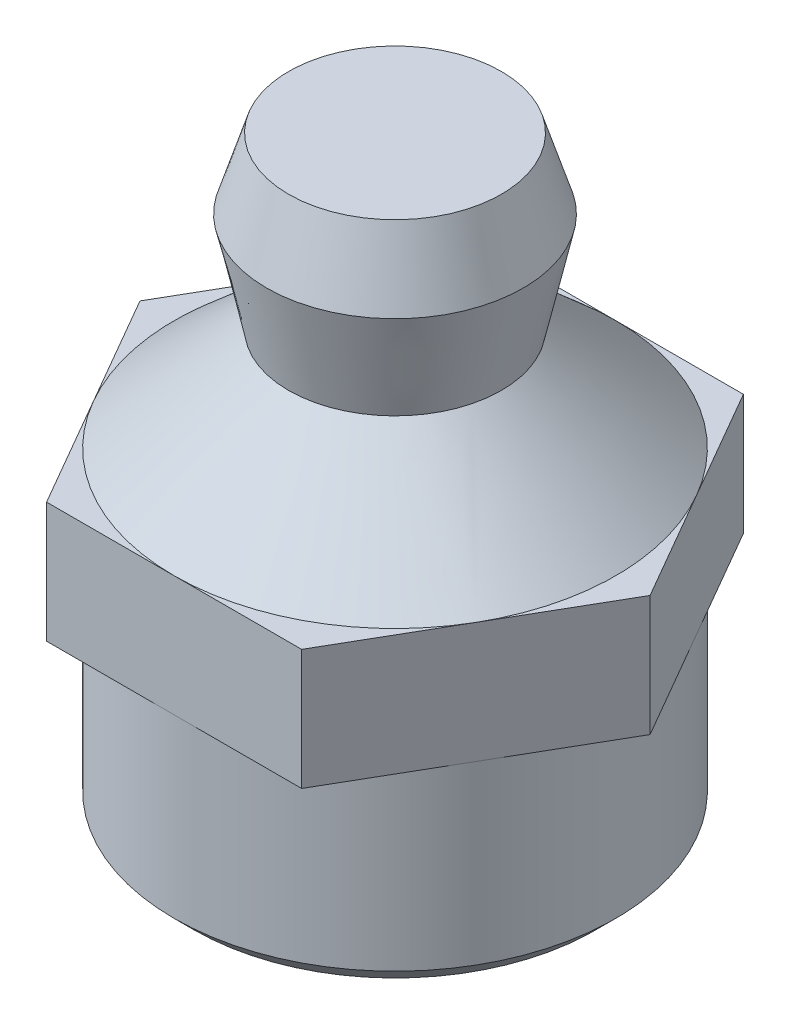
ISO-10303-21;
HEADER;
FILE_DESCRIPTION(('STEP AP214'),'2;1');
FILE_NAME('part.step','',(''),(''),'','','');
FILE_SCHEMA(('AUTOMOTIVE_DESIGN { 1 0 10303 214 1 1 1 1 }'));
ENDSEC;
DATA;
#1=APPLICATION_CONTEXT('core data for automotive mechanical design processes');
#2=APPLICATION_PROTOCOL_DEFINITION('international standard','automotive_design',2000,#1);
#3=PRODUCT_CONTEXT('',#1,'mechanical');
#4=PRODUCT('Part','Part','',(#3));
#5=PRODUCT_RELATED_PRODUCT_CATEGORY('part','',(#4));
#6=PRODUCT_DEFINITION_FORMATION('','',#4);
#7=PRODUCT_DEFINITION_CONTEXT('part definition',#1,'design');
#8=PRODUCT_DEFINITION('design','',#6,#7);
#9=PRODUCT_DEFINITION_SHAPE('','',#8);
#10=(LENGTH_UNIT() NAMED_UNIT(*) SI_UNIT(.MILLI.,.METRE.));
#11=(NAMED_UNIT(*) PLANE_ANGLE_UNIT() SI_UNIT($,.RADIAN.));
#12=(NAMED_UNIT(*) SI_UNIT($,.STERADIAN.) SOLID_ANGLE_UNIT());
#13=UNCERTAINTY_MEASURE_WITH_UNIT(LENGTH_MEASURE(1.E-05),#10,'distance_accuracy_value','');
#14=(GEOMETRIC_REPRESENTATION_CONTEXT(3) GLOBAL_UNCERTAINTY_ASSIGNED_CONTEXT((#13)) GLOBAL_UNIT_ASSIGNED_CONTEXT((#10,
#11,#12)) REPRESENTATION_CONTEXT('',''));
#15=CARTESIAN_POINT('',(0.,0.,0.));
#16=DIRECTION('',(0.,0.,1.));
#17=DIRECTION('',(1.,0.,0.));
#18=AXIS2_PLACEMENT_3D('',#15,#16,#17);
#19=CARTESIAN_POINT('',(0.,7.89,0.));
#20=DIRECTION('',(0.,1.,0.));
#21=DIRECTION('',(0.,0.,1.));
#22=AXIS2_PLACEMENT_3D('',#19,#20,#21);
#23=PLANE('',#22);
#24=CARTESIAN_POINT('',(0.,7.89,0.));
#25=DIRECTION('',(0.,1.,0.));
#26=DIRECTION('',(0.,0.,1.));
#27=AXIS2_PLACEMENT_3D('',#24,#25,#26);
#28=CIRCLE('',#27,5.5);
#29=CARTESIAN_POINT('',(4.76318355730142,7.89,2.74992407297728));
#30=VERTEX_POINT('',#29);
#31=CARTESIAN_POINT('',(4.76313972081441,7.89,-2.75));
#32=VERTEX_POINT('',#31);
#33=EDGE_CURVE('E183',#30,#32,#28,.T.);
#34=ORIENTED_EDGE('',*,*,#33,.F.);
#35=DIRECTION('',(0.5,0.,-0.866025403784439));
#36=VECTOR('',#35,1.);
#37=CARTESIAN_POINT('',(3.17542648054294,7.89,5.5));
#38=LINE('',#37,#36);
#39=CARTESIAN_POINT('',(6.35085296108589,7.89,0.));
#40=VERTEX_POINT('',#39);
#41=EDGE_CURVE('E171',#30,#40,#38,.T.);
#42=ORIENTED_EDGE('',*,*,#41,.T.);
#43=DIRECTION('',(-0.5,0.,-0.866025403784439));
#44=VECTOR('',#43,1.);
#45=CARTESIAN_POINT('',(6.35085296108589,7.89,0.));
#46=LINE('',#45,#44);
#47=EDGE_CURVE('E276',#40,#32,#46,.T.);
#48=ORIENTED_EDGE('',*,*,#47,.T.);
#49=EDGE_LOOP('',(#34,#42,#48));
#50=FACE_BOUND('',#49,.T.);
#51=ADVANCED_FACE('F48',(#50),#23,.T.);
#52=CARTESIAN_POINT('',(4.76299991361249,7.89,-2.750242153177));
#53=VERTEX_POINT('',#52);
#54=CARTESIAN_POINT('',(0.000547969122027901,7.89,-5.50000000000001));
#55=VERTEX_POINT('',#54);
#56=EDGE_CURVE('E264',#53,#55,#28,.T.);
#57=ORIENTED_EDGE('',*,*,#56,.F.);
#58=CARTESIAN_POINT('',(3.17542648054294,7.89,-5.50000000000001));
#59=VERTEX_POINT('',#58);
#60=EDGE_CURVE('E170',#53,#59,#46,.T.);
#61=ORIENTED_EDGE('',*,*,#60,.T.);
#62=DIRECTION('',(-1.,0.,0.));
#63=VECTOR('',#62,1.);
#64=CARTESIAN_POINT('',(3.17542648054294,7.89,-5.50000000000001));
#65=LINE('',#64,#63);
#66=EDGE_CURVE('E409',#59,#55,#65,.T.);
#67=ORIENTED_EDGE('',*,*,#66,.T.);
#68=EDGE_LOOP('',(#57,#61,#67));
#69=FACE_BOUND('',#68,.T.);
#70=ADVANCED_FACE('F509',(#69),#23,.T.);
#71=CARTESIAN_POINT('',(0.,7.89,-5.50000000000001));
#72=VERTEX_POINT('',#71);
#73=CARTESIAN_POINT('',(-4.76313972081442,7.89,-2.75));
#74=VERTEX_POINT('',#73);
#75=EDGE_CURVE('E67',#72,#74,#28,.T.);
#76=ORIENTED_EDGE('',*,*,#75,.F.);
#77=CARTESIAN_POINT('',(-3.17542648054294,7.89,-5.50000000000001));
#78=VERTEX_POINT('',#77);
#79=EDGE_CURVE('E398',#72,#78,#65,.T.);
#80=ORIENTED_EDGE('',*,*,#79,.T.);
#81=DIRECTION('',(-0.5,0.,0.866025403784439));
#82=VECTOR('',#81,1.);
#83=CARTESIAN_POINT('',(-3.17542648054294,7.89,-5.50000000000001));
#84=LINE('',#83,#82);
#85=EDGE_CURVE('E381',#78,#74,#84,.T.);
#86=ORIENTED_EDGE('',*,*,#85,.T.);
#87=EDGE_LOOP('',(#76,#80,#86));
#88=FACE_BOUND('',#87,.T.);
#89=ADVANCED_FACE('F415',(#88),#23,.T.);
#90=CARTESIAN_POINT('',(-4.76318355730102,7.89,-2.74992407297798));
#91=VERTEX_POINT('',#90);
#92=CARTESIAN_POINT('',(-4.76313972081442,7.89,2.75));
#93=VERTEX_POINT('',#92);
#94=EDGE_CURVE('E333',#91,#93,#28,.T.);
#95=ORIENTED_EDGE('',*,*,#94,.F.);
#96=CARTESIAN_POINT('',(-6.35085296108589,7.89,0.));
#97=VERTEX_POINT('',#96);
#98=EDGE_CURVE('E377',#91,#97,#84,.T.);
#99=ORIENTED_EDGE('',*,*,#98,.T.);
#100=DIRECTION('',(0.5,0.,0.866025403784439));
#101=VECTOR('',#100,1.);
#102=CARTESIAN_POINT('',(-6.35085296108589,7.89,0.));
#103=LINE('',#102,#101);
#104=EDGE_CURVE('E371',#97,#93,#103,.T.);
#105=ORIENTED_EDGE('',*,*,#104,.T.);
#106=EDGE_LOOP('',(#95,#99,#105));
#107=FACE_BOUND('',#106,.T.);
#108=ADVANCED_FACE('F376',(#107),#23,.T.);
#109=CARTESIAN_POINT('',(-4.76299991361188,7.89,2.75024215317805));
#110=VERTEX_POINT('',#109);
#111=CARTESIAN_POINT('',(0.,7.89,5.5));
#112=VERTEX_POINT('',#111);
#113=EDGE_CURVE('E190',#110,#112,#28,.T.);
#114=ORIENTED_EDGE('',*,*,#113,.F.);
#115=CARTESIAN_POINT('',(-3.17542648054294,7.89,5.5));
#116=VERTEX_POINT('',#115);
#117=EDGE_CURVE('E374',#110,#116,#103,.T.);
#118=ORIENTED_EDGE('',*,*,#117,.T.);
#119=DIRECTION('',(1.,0.,0.));
#120=VECTOR('',#119,1.);
#121=CARTESIAN_POINT('',(-3.17542648054294,7.89,5.5));
#122=LINE('',#121,#120);
#123=EDGE_CURVE('E379',#116,#112,#122,.T.);
#124=ORIENTED_EDGE('',*,*,#123,.T.);
#125=EDGE_LOOP('',(#114,#118,#124));
#126=FACE_BOUND('',#125,.T.);
#127=ADVANCED_FACE('F229',(#126),#23,.T.);
#128=CARTESIAN_POINT('',(0.,4.89,0.));
#129=DIRECTION('',(0.,-1.,0.));
#130=DIRECTION('',(0.,0.,-1.));
#131=AXIS2_PLACEMENT_3D('',#128,#129,#130);
#132=CYLINDRICAL_SURFACE('',#131,5.5);
#133=CARTESIAN_POINT('',(0.,0.499999999999999,0.));
#134=DIRECTION('',(0.,1.,0.));
#135=DIRECTION('',(0.,0.,1.));
#136=AXIS2_PLACEMENT_3D('',#133,#134,#135);
#137=CIRCLE('',#136,5.5);
#138=CARTESIAN_POINT('',(0.,0.499999999999999,5.5));
#139=VERTEX_POINT('',#138);
#140=EDGE_CURVE('E425',#139,#139,#137,.T.);
#141=ORIENTED_EDGE('',*,*,#140,.T.);
#142=EDGE_LOOP('',(#141));
#143=FACE_BOUND('',#142,.T.);
#144=CARTESIAN_POINT('',(0.,4.89,0.));
#145=DIRECTION('',(0.,1.,0.));
#146=DIRECTION('',(0.,0.,1.));
#147=AXIS2_PLACEMENT_3D('',#144,#145,#146);
#148=CIRCLE('',#147,5.5);
#149=CARTESIAN_POINT('',(0.,4.89,5.5));
#150=VERTEX_POINT('',#149);
#151=CARTESIAN_POINT('',(4.76313972081442,4.89,2.75));
#152=VERTEX_POINT('',#151);
#153=EDGE_CURVE('E428',#150,#152,#148,.T.);
#154=ORIENTED_EDGE('',*,*,#153,.F.);
#155=CARTESIAN_POINT('',(-4.76313972081442,4.89,2.75));
#156=VERTEX_POINT('',#155);
#157=EDGE_CURVE('E431',#156,#150,#148,.T.);
#158=ORIENTED_EDGE('',*,*,#157,.F.);
#159=CARTESIAN_POINT('',(-4.76313972081442,4.89,-2.75));
#160=VERTEX_POINT('',#159);
#161=EDGE_CURVE('E552',#160,#156,#148,.T.);
#162=ORIENTED_EDGE('',*,*,#161,.F.);
#163=CARTESIAN_POINT('',(0.,4.89,-5.5));
#164=VERTEX_POINT('',#163);
#165=EDGE_CURVE('E548',#164,#160,#148,.T.);
#166=ORIENTED_EDGE('',*,*,#165,.F.);
#167=CARTESIAN_POINT('',(4.76313972081442,4.89,-2.75));
#168=VERTEX_POINT('',#167);
#169=EDGE_CURVE('E547',#168,#164,#148,.T.);
#170=ORIENTED_EDGE('',*,*,#169,.F.);
#171=EDGE_CURVE('E430',#152,#168,#148,.T.);
#172=ORIENTED_EDGE('',*,*,#171,.F.);
#173=EDGE_LOOP('',(#154,#158,#162,#166,#170,#172));
#174=FACE_BOUND('',#173,.T.);
#175=ADVANCED_FACE('F522',(#143,#174),#132,.T.);
#176=CARTESIAN_POINT('',(0.,0.,0.));
#177=DIRECTION('',(0.,1.,0.));
#178=DIRECTION('',(0.,0.,1.));
#179=AXIS2_PLACEMENT_3D('',#176,#177,#178);
#180=PLANE('',#179);
#181=CARTESIAN_POINT('',(0.,0.,0.));
#182=DIRECTION('',(0.,-1.,0.));
#183=DIRECTION('',(0.,0.,-1.));
#184=AXIS2_PLACEMENT_3D('',#181,#182,#183);
#185=CIRCLE('',#184,2.22);
#186=CARTESIAN_POINT('',(0.,0.,-2.22));
#187=VERTEX_POINT('',#186);
#188=EDGE_CURVE('E12',#187,#187,#185,.T.);
#189=ORIENTED_EDGE('',*,*,#188,.F.);
#190=EDGE_LOOP('',(#189));
#191=FACE_BOUND('',#190,.T.);
#192=CARTESIAN_POINT('',(0.,0.,0.));
#193=DIRECTION('',(0.,1.,0.));
#194=DIRECTION('',(0.,0.,1.));
#195=AXIS2_PLACEMENT_3D('',#192,#193,#194);
#196=CIRCLE('',#195,5.);
#197=CARTESIAN_POINT('',(0.,0.,5.));
#198=VERTEX_POINT('',#197);
#199=EDGE_CURVE('E59',#198,#198,#196,.F.);
#200=ORIENTED_EDGE('',*,*,#199,.T.);
#201=EDGE_LOOP('',(#200));
#202=FACE_BOUND('',#201,.T.);
#203=ADVANCED_FACE('F527',(#191,#202),#180,.F.);
#204=CARTESIAN_POINT('',(0.,0.499999999999999,0.));
#205=DIRECTION('',(0.,1.,0.));
#206=DIRECTION('',(0.,0.,1.));
#207=AXIS2_PLACEMENT_3D('',#204,#205,#206);
#208=CONICAL_SURFACE('',#207,5.5,0.78539816339745);
#209=ORIENTED_EDGE('',*,*,#199,.F.);
#210=EDGE_LOOP('',(#209));
#211=FACE_BOUND('',#210,.T.);
#212=ORIENTED_EDGE('',*,*,#140,.F.);
#213=EDGE_LOOP('',(#212));
#214=FACE_BOUND('',#213,.T.);
#215=ADVANCED_FACE('F51',(#211,#214),#208,.T.);
#216=CARTESIAN_POINT('',(0.,-0.5,0.));
#217=DIRECTION('',(0.,1.,0.));
#218=DIRECTION('',(0.,0.,1.));
#219=AXIS2_PLACEMENT_3D('',#216,#217,#218);
#220=CYLINDRICAL_SURFACE('',#219,2.22);
#221=CARTESIAN_POINT('',(0.,-0.5,0.));
#222=DIRECTION('',(0.,-1.,0.));
#223=DIRECTION('',(0.,0.,-1.));
#224=AXIS2_PLACEMENT_3D('',#221,#222,#223);
#225=CIRCLE('',#224,2.22);
#226=CARTESIAN_POINT('',(0.,-0.5,-2.22));
#227=VERTEX_POINT('',#226);
#228=EDGE_CURVE('E433',#227,#227,#225,.T.);
#229=ORIENTED_EDGE('',*,*,#228,.F.);
#230=EDGE_LOOP('',(#229));
#231=FACE_BOUND('',#230,.T.);
#232=ORIENTED_EDGE('',*,*,#188,.T.);
#233=EDGE_LOOP('',(#232));
#234=FACE_BOUND('',#233,.T.);
#235=ADVANCED_FACE('F569',(#231,#234),#220,.T.);
#236=CARTESIAN_POINT('',(0.,-0.5,0.));
#237=DIRECTION('',(0.,-1.,0.));
#238=DIRECTION('',(0.,0.,-1.));
#239=AXIS2_PLACEMENT_3D('',#236,#237,#238);
#240=PLANE('',#239);
#241=ORIENTED_EDGE('',*,*,#228,.T.);
#242=EDGE_LOOP('',(#241));
#243=FACE_BOUND('',#242,.T.);
#244=ADVANCED_FACE('F564',(#243),#240,.T.);
#245=CARTESIAN_POINT('',(0.,4.89,0.));
#246=DIRECTION('',(0.,1.,0.));
#247=DIRECTION('',(0.,0.,1.));
#248=AXIS2_PLACEMENT_3D('',#245,#246,#247);
#249=PLANE('',#248);
#250=DIRECTION('',(1.,0.,0.));
#251=VECTOR('',#250,1.);
#252=CARTESIAN_POINT('',(-3.17542648054294,4.89,5.5));
#253=LINE('',#252,#251);
#254=CARTESIAN_POINT('',(3.17542648054294,4.89,5.5));
#255=VERTEX_POINT('',#254);
#256=EDGE_CURVE('E458',#150,#255,#253,.T.);
#257=ORIENTED_EDGE('',*,*,#256,.F.);
#258=ORIENTED_EDGE('',*,*,#153,.T.);
#259=DIRECTION('',(0.5,0.,-0.866025403784439));
#260=VECTOR('',#259,1.);
#261=CARTESIAN_POINT('',(3.17542648054294,4.89,5.5));
#262=LINE('',#261,#260);
#263=EDGE_CURVE('E453',#255,#152,#262,.T.);
#264=ORIENTED_EDGE('',*,*,#263,.F.);
#265=EDGE_LOOP('',(#257,#258,#264));
#266=FACE_BOUND('',#265,.T.);
#267=ADVANCED_FACE('F230',(#266),#249,.F.);
#268=CARTESIAN_POINT('',(6.35085296108589,4.89,0.));
#269=VERTEX_POINT('',#268);
#270=EDGE_CURVE('E455',#152,#269,#262,.T.);
#271=ORIENTED_EDGE('',*,*,#270,.F.);
#272=ORIENTED_EDGE('',*,*,#171,.T.);
#273=DIRECTION('',(-0.5,0.,-0.866025403784439));
#274=VECTOR('',#273,1.);
#275=CARTESIAN_POINT('',(6.35085296108589,4.89,0.));
#276=LINE('',#275,#274);
#277=EDGE_CURVE('E449',#269,#168,#276,.T.);
#278=ORIENTED_EDGE('',*,*,#277,.F.);
#279=EDGE_LOOP('',(#271,#272,#278));
#280=FACE_BOUND('',#279,.T.);
#281=ADVANCED_FACE('F540',(#280),#249,.F.);
#282=CARTESIAN_POINT('',(3.17542648054294,4.89,-5.50000000000001));
#283=VERTEX_POINT('',#282);
#284=EDGE_CURVE('E452',#168,#283,#276,.T.);
#285=ORIENTED_EDGE('',*,*,#284,.F.);
#286=ORIENTED_EDGE('',*,*,#169,.T.);
#287=DIRECTION('',(-1.,0.,0.));
#288=VECTOR('',#287,1.);
#289=CARTESIAN_POINT('',(3.17542648054294,4.89,-5.50000000000001));
#290=LINE('',#289,#288);
#291=EDGE_CURVE('E421',#283,#164,#290,.T.);
#292=ORIENTED_EDGE('',*,*,#291,.F.);
#293=EDGE_LOOP('',(#285,#286,#292));
#294=FACE_BOUND('',#293,.T.);
#295=ADVANCED_FACE('F546',(#294),#249,.F.);
#296=CARTESIAN_POINT('',(-3.17542648054294,4.89,-5.50000000000001));
#297=VERTEX_POINT('',#296);
#298=EDGE_CURVE('E418',#164,#297,#290,.T.);
#299=ORIENTED_EDGE('',*,*,#298,.F.);
#300=ORIENTED_EDGE('',*,*,#165,.T.);
#301=DIRECTION('',(-0.5,0.,0.866025403784439));
#302=VECTOR('',#301,1.);
#303=CARTESIAN_POINT('',(-3.17542648054294,4.89,-5.50000000000001));
#304=LINE('',#303,#302);
#305=EDGE_CURVE('E405',#297,#160,#304,.T.);
#306=ORIENTED_EDGE('',*,*,#305,.F.);
#307=EDGE_LOOP('',(#299,#300,#306));
#308=FACE_BOUND('',#307,.T.);
#309=ADVANCED_FACE('F551',(#308),#249,.F.);
#310=CARTESIAN_POINT('',(-6.35085296108589,4.89,0.));
#311=VERTEX_POINT('',#310);
#312=EDGE_CURVE('E463',#160,#311,#304,.T.);
#313=ORIENTED_EDGE('',*,*,#312,.F.);
#314=ORIENTED_EDGE('',*,*,#161,.T.);
#315=DIRECTION('',(0.5,0.,0.866025403784439));
#316=VECTOR('',#315,1.);
#317=CARTESIAN_POINT('',(-6.35085296108589,4.89,0.));
#318=LINE('',#317,#316);
#319=EDGE_CURVE('E459',#311,#156,#318,.T.);
#320=ORIENTED_EDGE('',*,*,#319,.F.);
#321=EDGE_LOOP('',(#313,#314,#320));
#322=FACE_BOUND('',#321,.T.);
#323=ADVANCED_FACE('F555',(#322),#249,.F.);
#324=CARTESIAN_POINT('',(-3.17542648054294,4.89,5.5));
#325=VERTEX_POINT('',#324);
#326=EDGE_CURVE('E460',#156,#325,#318,.T.);
#327=ORIENTED_EDGE('',*,*,#326,.F.);
#328=ORIENTED_EDGE('',*,*,#157,.T.);
#329=EDGE_CURVE('E456',#325,#150,#253,.T.);
#330=ORIENTED_EDGE('',*,*,#329,.F.);
#331=EDGE_LOOP('',(#327,#328,#330));
#332=FACE_BOUND('',#331,.T.);
#333=ADVANCED_FACE('F557',(#332),#249,.F.);
#334=CARTESIAN_POINT('',(-3.17542648054294,7.89,-5.50000000000001));
#335=DIRECTION('',(0.866025403784439,0.,0.5));
#336=DIRECTION('',(0.5,0.,-0.866025403784439));
#337=AXIS2_PLACEMENT_3D('',#334,#335,#336);
#338=PLANE('',#337);
#339=ORIENTED_EDGE('',*,*,#305,.T.);
#340=ORIENTED_EDGE('',*,*,#312,.T.);
#341=DIRECTION('',(0.,-1.,0.));
#342=VECTOR('',#341,1.);
#343=CARTESIAN_POINT('',(-6.35085296108589,7.89,0.));
#344=LINE('',#343,#342);
#345=EDGE_CURVE('E436',#97,#311,#344,.T.);
#346=ORIENTED_EDGE('',*,*,#345,.F.);
#347=ORIENTED_EDGE('',*,*,#98,.F.);
#348=EDGE_CURVE('E336',#74,#91,#28,.T.);
#349=ORIENTED_EDGE('',*,*,#348,.F.);
#350=ORIENTED_EDGE('',*,*,#85,.F.);
#351=DIRECTION('',(0.,-1.,0.));
#352=VECTOR('',#351,1.);
#353=CARTESIAN_POINT('',(-3.17542648054294,7.89,-5.50000000000001));
#354=LINE('',#353,#352);
#355=EDGE_CURVE('E410',#78,#297,#354,.T.);
#356=ORIENTED_EDGE('',*,*,#355,.T.);
#357=EDGE_LOOP('',(#339,#340,#346,#347,#349,#350,#356));
#358=FACE_BOUND('',#357,.T.);
#359=ADVANCED_FACE('F316',(#358),#338,.F.);
#360=CARTESIAN_POINT('',(-6.35085296108589,7.89,0.));
#361=DIRECTION('',(0.866025403784439,0.,-0.5));
#362=DIRECTION('',(-0.5,0.,-0.866025403784439));
#363=AXIS2_PLACEMENT_3D('',#360,#361,#362);
#364=PLANE('',#363);
#365=ORIENTED_EDGE('',*,*,#319,.T.);
#366=ORIENTED_EDGE('',*,*,#326,.T.);
#367=DIRECTION('',(0.,-1.,0.));
#368=VECTOR('',#367,1.);
#369=CARTESIAN_POINT('',(-3.17542648054294,7.89,5.5));
#370=LINE('',#369,#368);
#371=EDGE_CURVE('E438',#116,#325,#370,.T.);
#372=ORIENTED_EDGE('',*,*,#371,.F.);
#373=ORIENTED_EDGE('',*,*,#117,.F.);
#374=EDGE_CURVE('E326',#93,#110,#28,.T.);
#375=ORIENTED_EDGE('',*,*,#374,.F.);
#376=ORIENTED_EDGE('',*,*,#104,.F.);
#377=ORIENTED_EDGE('',*,*,#345,.T.);
#378=EDGE_LOOP('',(#365,#366,#372,#373,#375,#376,#377));
#379=FACE_BOUND('',#378,.T.);
#380=ADVANCED_FACE('F311',(#379),#364,.F.);
#381=CARTESIAN_POINT('',(-3.17542648054294,7.89,5.5));
#382=DIRECTION('',(0.,0.,-1.));
#383=DIRECTION('',(-1.,0.,0.));
#384=AXIS2_PLACEMENT_3D('',#381,#382,#383);
#385=PLANE('',#384);
#386=ORIENTED_EDGE('',*,*,#329,.T.);
#387=ORIENTED_EDGE('',*,*,#256,.T.);
#388=DIRECTION('',(0.,-1.,0.));
#389=VECTOR('',#388,1.);
#390=CARTESIAN_POINT('',(3.17542648054294,7.89,5.5));
#391=LINE('',#390,#389);
#392=CARTESIAN_POINT('',(3.17542648054294,7.89,5.5));
#393=VERTEX_POINT('',#392);
#394=EDGE_CURVE('E441',#393,#255,#391,.T.);
#395=ORIENTED_EDGE('',*,*,#394,.F.);
#396=EDGE_CURVE('E166',#112,#393,#122,.T.);
#397=ORIENTED_EDGE('',*,*,#396,.F.);
#398=ORIENTED_EDGE('',*,*,#123,.F.);
#399=ORIENTED_EDGE('',*,*,#371,.T.);
#400=EDGE_LOOP('',(#386,#387,#395,#397,#398,#399));
#401=FACE_BOUND('',#400,.T.);
#402=ADVANCED_FACE('F301',(#401),#385,.F.);
#403=CARTESIAN_POINT('',(3.17542648054294,7.89,5.5));
#404=DIRECTION('',(-0.866025403784439,0.,-0.5));
#405=DIRECTION('',(-0.5,0.,0.866025403784439));
#406=AXIS2_PLACEMENT_3D('',#403,#404,#405);
#407=PLANE('',#406);
#408=ORIENTED_EDGE('',*,*,#263,.T.);
#409=ORIENTED_EDGE('',*,*,#270,.T.);
#410=DIRECTION('',(0.,-1.,0.));
#411=VECTOR('',#410,1.);
#412=CARTESIAN_POINT('',(6.35085296108589,7.89,0.));
#413=LINE('',#412,#411);
#414=EDGE_CURVE('E443',#40,#269,#413,.T.);
#415=ORIENTED_EDGE('',*,*,#414,.F.);
#416=ORIENTED_EDGE('',*,*,#41,.F.);
#417=CARTESIAN_POINT('',(4.76314281114502,7.89,2.75000178433494));
#418=VERTEX_POINT('',#417);
#419=EDGE_CURVE('E53',#418,#30,#28,.T.);
#420=ORIENTED_EDGE('',*,*,#419,.F.);
#421=EDGE_CURVE('E159',#393,#418,#38,.T.);
#422=ORIENTED_EDGE('',*,*,#421,.F.);
#423=ORIENTED_EDGE('',*,*,#394,.T.);
#424=EDGE_LOOP('',(#408,#409,#415,#416,#420,#422,#423));
#425=FACE_BOUND('',#424,.T.);
#426=ADVANCED_FACE('F177',(#425),#407,.F.);
#427=CARTESIAN_POINT('',(6.35085296108589,7.89,0.));
#428=DIRECTION('',(-0.866025403784438,0.,0.5));
#429=DIRECTION('',(0.5,0.,0.866025403784439));
#430=AXIS2_PLACEMENT_3D('',#427,#428,#429);
#431=PLANE('',#430);
#432=ORIENTED_EDGE('',*,*,#277,.T.);
#433=ORIENTED_EDGE('',*,*,#284,.T.);
#434=DIRECTION('',(0.,-1.,0.));
#435=VECTOR('',#434,1.);
#436=CARTESIAN_POINT('',(3.17542648054294,7.89,-5.50000000000001));
#437=LINE('',#436,#435);
#438=EDGE_CURVE('E412',#59,#283,#437,.T.);
#439=ORIENTED_EDGE('',*,*,#438,.F.);
#440=ORIENTED_EDGE('',*,*,#60,.F.);
#441=EDGE_CURVE('E279',#32,#53,#28,.T.);
#442=ORIENTED_EDGE('',*,*,#441,.F.);
#443=ORIENTED_EDGE('',*,*,#47,.F.);
#444=ORIENTED_EDGE('',*,*,#414,.T.);
#445=EDGE_LOOP('',(#432,#433,#439,#440,#442,#443,#444));
#446=FACE_BOUND('',#445,.T.);
#447=ADVANCED_FACE('F287',(#446),#431,.F.);
#448=CARTESIAN_POINT('',(3.17542648054294,7.89,-5.50000000000001));
#449=DIRECTION('',(0.,0.,1.));
#450=DIRECTION('',(1.,0.,0.));
#451=AXIS2_PLACEMENT_3D('',#448,#449,#450);
#452=PLANE('',#451);
#453=ORIENTED_EDGE('',*,*,#291,.T.);
#454=ORIENTED_EDGE('',*,*,#298,.T.);
#455=ORIENTED_EDGE('',*,*,#355,.F.);
#456=ORIENTED_EDGE('',*,*,#79,.F.);
#457=EDGE_CURVE('E75',#55,#72,#28,.T.);
#458=ORIENTED_EDGE('',*,*,#457,.F.);
#459=ORIENTED_EDGE('',*,*,#66,.F.);
#460=ORIENTED_EDGE('',*,*,#438,.T.);
#461=EDGE_LOOP('',(#453,#454,#455,#456,#458,#459,#460));
#462=FACE_BOUND('',#461,.T.);
#463=ADVANCED_FACE('F228',(#462),#452,.F.);
#464=EDGE_CURVE('E163',#112,#418,#28,.T.);
#465=ORIENTED_EDGE('',*,*,#464,.F.);
#466=ORIENTED_EDGE('',*,*,#396,.T.);
#467=ORIENTED_EDGE('',*,*,#421,.T.);
#468=EDGE_LOOP('',(#465,#466,#467));
#469=FACE_BOUND('',#468,.T.);
#470=ADVANCED_FACE('F161',(#469),#23,.T.);
#471=CARTESIAN_POINT('',(2.92074030219568,7.89,4.66039441325838));
#472=CARTESIAN_POINT('',(1.95440976099916,10.46,1.78963194152071));
#473=CARTESIAN_POINT('',(12.2415291287124,7.89,-1.18108619113299));
#474=CARTESIAN_POINT('',(5.53367364404059,10.46,-2.11918758047761));
#475=CARTESIAN_POINT('',(6.40004852432107,7.89,-10.5018750176497));
#476=CARTESIAN_POINT('',(1.62485412204227,10.46,-5.69845146351904));
#477=CARTESIAN_POINT('',(-2.92074030219568,7.89,-4.66039441325838));
#478=CARTESIAN_POINT('',(-1.95440976099916,10.46,-1.78963194152072));
#479=CARTESIAN_POINT('',(-12.2415291287124,7.89,1.18108619113298));
#480=CARTESIAN_POINT('',(-5.53367364404059,10.46,2.1191875804776));
#481=CARTESIAN_POINT('',(-6.40004852432107,7.89,10.5018750176497));
#482=CARTESIAN_POINT('',(-1.62485412204227,10.46,5.69845146351904));
#483=CARTESIAN_POINT('',(2.92074030219568,7.89,4.66039441325838));
#484=CARTESIAN_POINT('',(1.95440976099916,10.46,1.78963194152071));
#485=(BOUNDED_SURFACE() B_SPLINE_SURFACE(3,1,((#471,#472),(#473,#474),(#475,#476),(#477,#478),
(#479,#480),(#481,#482),(#483,#484)),.UNSPECIFIED.,.T.,.F.,.F.) B_SPLINE_SURFACE_WITH_KNOTS((4,
3,4),(2,2),(0.,0.5,1.),(0.,1.),
.UNSPECIFIED.) GEOMETRIC_REPRESENTATION_ITEM() RATIONAL_B_SPLINE_SURFACE(((1.,1.),
(0.333333333333333,0.333333333333333),(0.333333333333333,0.333333333333333),(1.,1.),
(0.333333333333333,0.333333333333333),(0.333333333333333,0.333333333333333),(1.,1.))) REPRESENTATION_ITEM('') SURFACE());
#486=CARTESIAN_POINT('',(0.,10.46,0.));
#487=DIRECTION('',(0.,1.,0.));
#488=DIRECTION('',(0.,0.,1.));
#489=AXIS2_PLACEMENT_3D('',#486,#487,#488);
#490=CIRCLE('',#489,2.65);
#491=CARTESIAN_POINT('',(0.,10.46,2.65));
#492=VERTEX_POINT('',#491);
#493=EDGE_CURVE('E182',#492,#492,#490,.T.);
#494=ORIENTED_EDGE('',*,*,#419,.T.);
#495=ORIENTED_EDGE('',*,*,#33,.T.);
#496=ORIENTED_EDGE('',*,*,#441,.T.);
#497=ORIENTED_EDGE('',*,*,#56,.T.);
#498=ORIENTED_EDGE('',*,*,#457,.T.);
#499=ORIENTED_EDGE('',*,*,#75,.T.);
#500=ORIENTED_EDGE('',*,*,#348,.T.);
#501=ORIENTED_EDGE('',*,*,#94,.T.);
#502=ORIENTED_EDGE('',*,*,#374,.T.);
#503=ORIENTED_EDGE('',*,*,#113,.T.);
#504=ORIENTED_EDGE('',*,*,#464,.T.);
#505=EDGE_LOOP('',(#494,#495,#496,#497,#498,#499,#500,#501,#502,#503,#504));
#506=FACE_BOUND('',#505,.T.);
#507=ORIENTED_EDGE('',*,*,#493,.F.);
#508=EDGE_LOOP('',(#507));
#509=FACE_BOUND('',#508,.T.);
#510=ADVANCED_FACE('F187',(#506,#509),#485,.T.);
#511=CARTESIAN_POINT('',(0.,10.46,0.));
#512=DIRECTION('',(0.,1.,0.));
#513=DIRECTION('',(0.,0.,1.));
#514=AXIS2_PLACEMENT_3D('',#511,#512,#513);
#515=CONICAL_SURFACE('',#514,2.65,0.216319526873336);
#516=ORIENTED_EDGE('',*,*,#493,.T.);
#517=EDGE_LOOP('',(#516));
#518=FACE_BOUND('',#517,.T.);
#519=CARTESIAN_POINT('',(0.,12.94,0.));
#520=DIRECTION('',(0.,1.,0.));
#521=DIRECTION('',(0.,0.,1.));
#522=AXIS2_PLACEMENT_3D('',#519,#520,#521);
#523=CIRCLE('',#522,3.195);
#524=CARTESIAN_POINT('',(0.,12.94,3.195));
#525=VERTEX_POINT('',#524);
#526=EDGE_CURVE('E192',#525,#525,#523,.T.);
#527=ORIENTED_EDGE('',*,*,#526,.F.);
#528=EDGE_LOOP('',(#527));
#529=FACE_BOUND('',#528,.T.);
#530=ADVANCED_FACE('F218',(#518,#529),#515,.T.);
#531=CARTESIAN_POINT('',(0.,14.69,0.));
#532=DIRECTION('',(0.,1.,0.));
#533=DIRECTION('',(0.,0.,1.));
#534=AXIS2_PLACEMENT_3D('',#531,#532,#533);
#535=PLANE('',#534);
#536=CARTESIAN_POINT('',(0.,14.69,0.));
#537=DIRECTION('',(0.,1.,0.));
#538=DIRECTION('',(0.,0.,1.));
#539=AXIS2_PLACEMENT_3D('',#536,#537,#538);
#540=CIRCLE('',#539,2.65);
#541=CARTESIAN_POINT('',(0.,14.69,2.65));
#542=VERTEX_POINT('',#541);
#543=EDGE_CURVE('E474',#542,#542,#540,.T.);
#544=ORIENTED_EDGE('',*,*,#543,.T.);
#545=EDGE_LOOP('',(#544));
#546=FACE_BOUND('',#545,.T.);
#547=ADVANCED_FACE('F470',(#546),#535,.T.);
#548=CARTESIAN_POINT('',(0.,14.69,0.));
#549=DIRECTION('',(0.,-1.,0.));
#550=DIRECTION('',(0.,0.,-1.));
#551=AXIS2_PLACEMENT_3D('',#548,#549,#550);
#552=CONICAL_SURFACE('',#551,2.65,0.301908465105114);
#553=ORIENTED_EDGE('',*,*,#526,.T.);
#554=EDGE_LOOP('',(#553));
#555=FACE_BOUND('',#554,.T.);
#556=ORIENTED_EDGE('',*,*,#543,.F.);
#557=EDGE_LOOP('',(#556));
#558=FACE_BOUND('',#557,.T.);
#559=ADVANCED_FACE('F492',(#555,#558),#552,.T.);
#560=CLOSED_SHELL('',(#51,#70,#89,#108,#127,#175,#203,#215,#235,#244,#267,#281,#295,#309,#323,
#333,#359,#380,#402,#426,#447,#463,#470,#510,#530,#547,#559));
#561=MANIFOLD_SOLID_BREP('B2',#560);
#562=ADVANCED_BREP_SHAPE_REPRESENTATION('',(#18,#561),#14);
#563=SHAPE_DEFINITION_REPRESENTATION(#9,#562);
ENDSEC;
END-ISO-10303-21;
